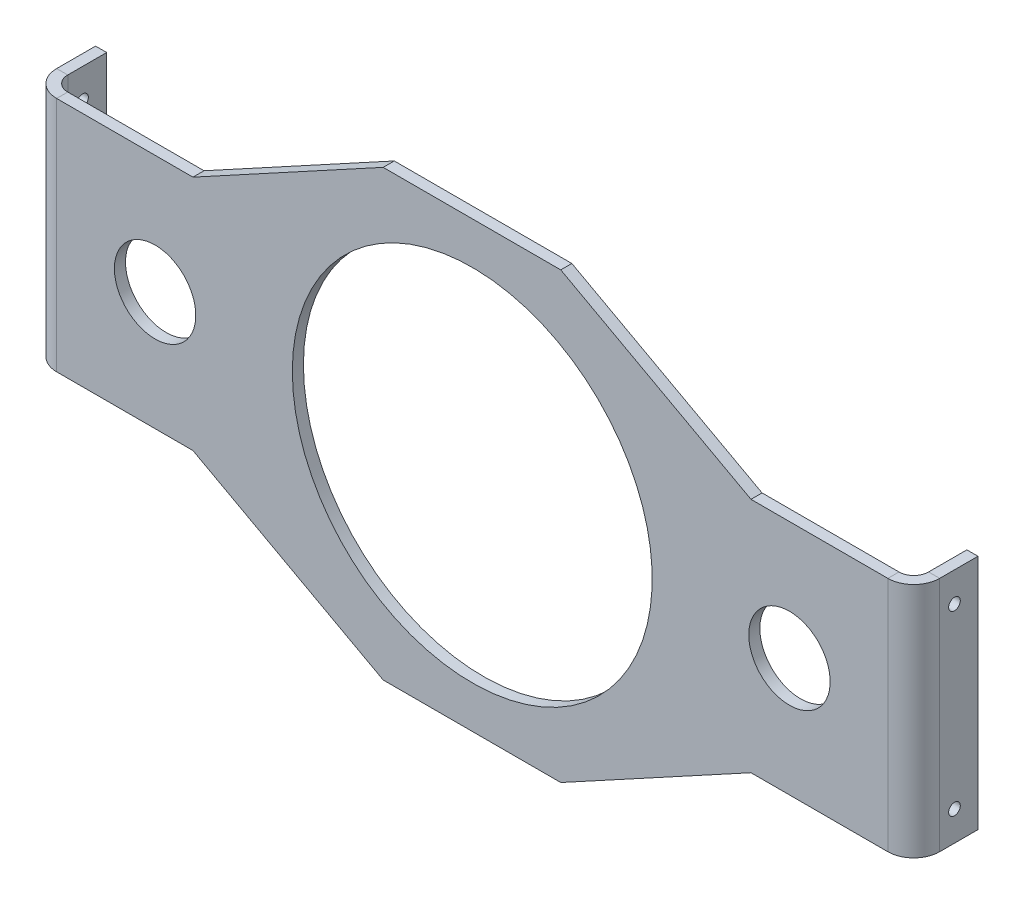
ISO-10303-21;
HEADER;
FILE_DESCRIPTION(('STEP AP214'),'2;1');
FILE_NAME('part.step','',(''),(''),'','','');
FILE_SCHEMA(('AUTOMOTIVE_DESIGN { 1 0 10303 214 1 1 1 1 }'));
ENDSEC;
DATA;
#1=APPLICATION_CONTEXT('core data for automotive mechanical design processes');
#2=APPLICATION_PROTOCOL_DEFINITION('international standard','automotive_design',2000,#1);
#3=PRODUCT_CONTEXT('',#1,'mechanical');
#4=PRODUCT('Part','Part','',(#3));
#5=PRODUCT_RELATED_PRODUCT_CATEGORY('part','',(#4));
#6=PRODUCT_DEFINITION_FORMATION('','',#4);
#7=PRODUCT_DEFINITION_CONTEXT('part definition',#1,'design');
#8=PRODUCT_DEFINITION('design','',#6,#7);
#9=PRODUCT_DEFINITION_SHAPE('','',#8);
#10=(LENGTH_UNIT() NAMED_UNIT(*) SI_UNIT(.MILLI.,.METRE.));
#11=(NAMED_UNIT(*) PLANE_ANGLE_UNIT() SI_UNIT($,.RADIAN.));
#12=(NAMED_UNIT(*) SI_UNIT($,.STERADIAN.) SOLID_ANGLE_UNIT());
#13=UNCERTAINTY_MEASURE_WITH_UNIT(LENGTH_MEASURE(1.E-05),#10,'distance_accuracy_value','');
#14=(GEOMETRIC_REPRESENTATION_CONTEXT(3) GLOBAL_UNCERTAINTY_ASSIGNED_CONTEXT((#13)) GLOBAL_UNIT_ASSIGNED_CONTEXT((#10,
#11,#12)) REPRESENTATION_CONTEXT('',''));
#15=CARTESIAN_POINT('',(0.,0.,0.));
#16=DIRECTION('',(0.,0.,1.));
#17=DIRECTION('',(1.,0.,0.));
#18=AXIS2_PLACEMENT_3D('',#15,#16,#17);
#19=CARTESIAN_POINT('',(0.,0.,2.38125));
#20=DIRECTION('',(0.,0.,-1.));
#21=DIRECTION('',(-1.,0.,0.));
#22=AXIS2_PLACEMENT_3D('',#19,#20,#21);
#23=PLANE('',#22);
#24=CARTESIAN_POINT('',(-18.9499999999988,57.1499999999993,2.38125));
#25=DIRECTION('',(0.,0.,-1.));
#26=DIRECTION('',(-1.,0.,0.));
#27=AXIS2_PLACEMENT_3D('',#24,#25,#26);
#28=CIRCLE('',#27,8.73125);
#29=CARTESIAN_POINT('',(-27.6812499999988,57.1499999999993,2.38125));
#30=VERTEX_POINT('',#29);
#31=EDGE_CURVE('E262',#30,#30,#28,.T.);
#32=ORIENTED_EDGE('',*,*,#31,.T.);
#33=EDGE_LOOP('',(#32));
#34=FACE_BOUND('',#33,.T.);
#35=CARTESIAN_POINT('',(117.150000000001,57.1499999999993,2.38125));
#36=DIRECTION('',(0.,0.,-1.));
#37=DIRECTION('',(-1.,0.,0.));
#38=AXIS2_PLACEMENT_3D('',#35,#36,#37);
#39=CIRCLE('',#38,8.73125);
#40=CARTESIAN_POINT('',(108.418750000001,57.1499999999993,2.38125));
#41=VERTEX_POINT('',#40);
#42=EDGE_CURVE('E259',#41,#41,#39,.T.);
#43=ORIENTED_EDGE('',*,*,#42,.T.);
#44=EDGE_LOOP('',(#43));
#45=FACE_BOUND('',#44,.T.);
#46=CARTESIAN_POINT('',(49.1000000000012,57.1499999999993,2.38125));
#47=DIRECTION('',(0.,0.,-1.));
#48=DIRECTION('',(-1.,0.,0.));
#49=AXIS2_PLACEMENT_3D('',#46,#47,#48);
#50=CIRCLE('',#49,38.608);
#51=CARTESIAN_POINT('',(10.4920000000012,57.1499999999993,2.38125));
#52=VERTEX_POINT('',#51);
#53=EDGE_CURVE('E256',#52,#52,#50,.T.);
#54=ORIENTED_EDGE('',*,*,#53,.T.);
#55=EDGE_LOOP('',(#54));
#56=FACE_BOUND('',#55,.T.);
#57=DIRECTION('',(-1.,0.,0.));
#58=VECTOR('',#57,1.);
#59=CARTESIAN_POINT('',(0.,82.55,2.38125));
#60=LINE('',#59,#58);
#61=CARTESIAN_POINT('',(-10.8241193173597,82.55,2.38125));
#62=VERTEX_POINT('',#61);
#63=CARTESIAN_POINT('',(-40.0658693173598,82.55,2.38125));
#64=VERTEX_POINT('',#63);
#65=EDGE_CURVE('E70',#62,#64,#60,.T.);
#66=ORIENTED_EDGE('',*,*,#65,.T.);
#67=DIRECTION('',(0.,-1.,0.));
#68=VECTOR('',#67,1.);
#69=CARTESIAN_POINT('',(-40.0658693173598,0.,2.38125));
#70=LINE('',#69,#68);
#71=CARTESIAN_POINT('',(-40.0658693173598,31.75,2.38125));
#72=VERTEX_POINT('',#71);
#73=EDGE_CURVE('E62',#64,#72,#70,.T.);
#74=ORIENTED_EDGE('',*,*,#73,.T.);
#75=DIRECTION('',(-1.,0.,0.));
#76=VECTOR('',#75,1.);
#77=CARTESIAN_POINT('',(0.,31.75,2.38125));
#78=LINE('',#77,#76);
#79=CARTESIAN_POINT('',(-10.8241193173597,31.75,2.38125));
#80=VERTEX_POINT('',#79);
#81=EDGE_CURVE('E78',#72,#80,#78,.F.);
#82=ORIENTED_EDGE('',*,*,#81,.T.);
#83=DIRECTION('',(0.878215054439322,-0.478265949191596,0.));
#84=VECTOR('',#83,1.);
#85=CARTESIAN_POINT('',(-10.8241193173597,31.75,2.38125));
#86=LINE('',#85,#84);
#87=CARTESIAN_POINT('',(29.9865,9.52499999999998,2.38125));
#88=VERTEX_POINT('',#87);
#89=EDGE_CURVE('E274',#80,#88,#86,.T.);
#90=ORIENTED_EDGE('',*,*,#89,.T.);
#91=DIRECTION('',(-1.,0.,0.));
#92=VECTOR('',#91,1.);
#93=CARTESIAN_POINT('',(0.,9.52499999999998,2.38125));
#94=LINE('',#93,#92);
#95=CARTESIAN_POINT('',(68.0865,9.52499999999998,2.38125));
#96=VERTEX_POINT('',#95);
#97=EDGE_CURVE('E271',#88,#96,#94,.F.);
#98=ORIENTED_EDGE('',*,*,#97,.T.);
#99=DIRECTION('',(0.878215054439322,0.478265949191596,0.));
#100=VECTOR('',#99,1.);
#101=CARTESIAN_POINT('',(68.0865,9.52499999999998,2.38125));
#102=LINE('',#101,#100);
#103=CARTESIAN_POINT('',(108.89711931736,31.75,2.38125));
#104=VERTEX_POINT('',#103);
#105=EDGE_CURVE('E268',#96,#104,#102,.T.);
#106=ORIENTED_EDGE('',*,*,#105,.T.);
#107=DIRECTION('',(-1.,0.,0.));
#108=VECTOR('',#107,1.);
#109=CARTESIAN_POINT('',(0.,31.75,2.38125));
#110=LINE('',#109,#108);
#111=CARTESIAN_POINT('',(138.26586931736,31.75,2.38125));
#112=VERTEX_POINT('',#111);
#113=EDGE_CURVE('E265',#104,#112,#110,.F.);
#114=ORIENTED_EDGE('',*,*,#113,.T.);
#115=DIRECTION('',(0.,-1.,0.));
#116=VECTOR('',#115,1.);
#117=CARTESIAN_POINT('',(138.26586931736,0.,2.38125));
#118=LINE('',#117,#116);
#119=CARTESIAN_POINT('',(138.26586931736,82.55,2.38125));
#120=VERTEX_POINT('',#119);
#121=EDGE_CURVE('E245',#120,#112,#118,.T.);
#122=ORIENTED_EDGE('',*,*,#121,.F.);
#123=DIRECTION('',(-1.,0.,0.));
#124=VECTOR('',#123,1.);
#125=CARTESIAN_POINT('',(0.,82.55,2.38125));
#126=LINE('',#125,#124);
#127=CARTESIAN_POINT('',(108.89711931736,82.55,2.38125));
#128=VERTEX_POINT('',#127);
#129=EDGE_CURVE('E285',#120,#128,#126,.T.);
#130=ORIENTED_EDGE('',*,*,#129,.T.);
#131=DIRECTION('',(-0.878215054439322,0.478265949191596,0.));
#132=VECTOR('',#131,1.);
#133=CARTESIAN_POINT('',(68.0865,104.775,2.38125));
#134=LINE('',#133,#132);
#135=CARTESIAN_POINT('',(68.0865,104.775,2.38125));
#136=VERTEX_POINT('',#135);
#137=EDGE_CURVE('E282',#128,#136,#134,.T.);
#138=ORIENTED_EDGE('',*,*,#137,.T.);
#139=DIRECTION('',(-1.,0.,0.));
#140=VECTOR('',#139,1.);
#141=CARTESIAN_POINT('',(0.,104.775,2.38125));
#142=LINE('',#141,#140);
#143=CARTESIAN_POINT('',(29.9865,104.775,2.38125));
#144=VERTEX_POINT('',#143);
#145=EDGE_CURVE('E279',#136,#144,#142,.T.);
#146=ORIENTED_EDGE('',*,*,#145,.T.);
#147=DIRECTION('',(-0.878215054439322,-0.478265949191596,0.));
#148=VECTOR('',#147,1.);
#149=CARTESIAN_POINT('',(-10.8241193173597,82.55,2.38125));
#150=LINE('',#149,#148);
#151=EDGE_CURVE('E277',#144,#62,#150,.T.);
#152=ORIENTED_EDGE('',*,*,#151,.T.);
#153=EDGE_LOOP('',(#66,#74,#82,#90,#98,#106,#114,#122,#130,#138,#146,#152));
#154=FACE_BOUND('',#153,.T.);
#155=ADVANCED_FACE('F53',(#34,#45,#56,#154),#23,.F.);
#156=CARTESIAN_POINT('',(143.82211931736,0.,141.948377031524));
#157=DIRECTION('',(-1.,0.,0.));
#158=DIRECTION('',(0.,0.,1.));
#159=AXIS2_PLACEMENT_3D('',#156,#157,#158);
#160=PLANE('',#159);
#161=CARTESIAN_POINT('',(143.82211931736,76.2,-6.35000000000025));
#162=DIRECTION('',(1.,0.,0.));
#163=DIRECTION('',(0.,0.,-1.));
#164=AXIS2_PLACEMENT_3D('',#161,#162,#163);
#165=CIRCLE('',#164,1.25);
#166=CARTESIAN_POINT('',(143.82211931736,76.2,-7.60000000000025));
#167=VERTEX_POINT('',#166);
#168=EDGE_CURVE('E918',#167,#167,#165,.T.);
#169=ORIENTED_EDGE('',*,*,#168,.F.);
#170=EDGE_LOOP('',(#169));
#171=FACE_BOUND('',#170,.T.);
#172=CARTESIAN_POINT('',(143.82211931736,38.1,-6.35000000000022));
#173=DIRECTION('',(1.,0.,0.));
#174=DIRECTION('',(0.,0.,-1.));
#175=AXIS2_PLACEMENT_3D('',#172,#173,#174);
#176=CIRCLE('',#175,1.25);
#177=CARTESIAN_POINT('',(143.82211931736,38.1,-7.60000000000022));
#178=VERTEX_POINT('',#177);
#179=EDGE_CURVE('E884',#178,#178,#176,.T.);
#180=ORIENTED_EDGE('',*,*,#179,.F.);
#181=EDGE_LOOP('',(#180));
#182=FACE_BOUND('',#181,.T.);
#183=DIRECTION('',(0.,0.,1.));
#184=VECTOR('',#183,1.);
#185=CARTESIAN_POINT('',(143.82211931736,82.55,141.948377031524));
#186=LINE('',#185,#184);
#187=CARTESIAN_POINT('',(143.82211931736,82.55,-11.398742285836));
#188=VERTEX_POINT('',#187);
#189=CARTESIAN_POINT('',(143.82211931736,82.55,-3.17500000000001));
#190=VERTEX_POINT('',#189);
#191=EDGE_CURVE('E252',#188,#190,#186,.T.);
#192=ORIENTED_EDGE('',*,*,#191,.T.);
#193=DIRECTION('',(0.,-1.,0.));
#194=VECTOR('',#193,1.);
#195=CARTESIAN_POINT('',(143.82211931736,0.,-3.17500000000001));
#196=LINE('',#195,#194);
#197=CARTESIAN_POINT('',(143.82211931736,31.75,-3.17500000000001));
#198=VERTEX_POINT('',#197);
#199=EDGE_CURVE('E363',#190,#198,#196,.T.);
#200=ORIENTED_EDGE('',*,*,#199,.T.);
#201=DIRECTION('',(0.,0.,1.));
#202=VECTOR('',#201,1.);
#203=CARTESIAN_POINT('',(143.82211931736,31.75,141.948377031524));
#204=LINE('',#203,#202);
#205=CARTESIAN_POINT('',(143.82211931736,31.75,-11.398742285836));
#206=VERTEX_POINT('',#205);
#207=EDGE_CURVE('E351',#198,#206,#204,.F.);
#208=ORIENTED_EDGE('',*,*,#207,.T.);
#209=DIRECTION('',(0.,1.,0.));
#210=VECTOR('',#209,1.);
#211=CARTESIAN_POINT('',(143.82211931736,0.,-11.398742285836));
#212=LINE('',#211,#210);
#213=EDGE_CURVE('E348',#206,#188,#212,.T.);
#214=ORIENTED_EDGE('',*,*,#213,.T.);
#215=EDGE_LOOP('',(#192,#200,#208,#214));
#216=FACE_BOUND('',#215,.T.);
#217=ADVANCED_FACE('F426',(#171,#182,#216),#160,.F.);
#218=CARTESIAN_POINT('',(141.44086931736,82.55,33.051257714164));
#219=DIRECTION('',(0.,-1.,0.));
#220=DIRECTION('',(0.,0.,1.));
#221=AXIS2_PLACEMENT_3D('',#218,#219,#220);
#222=PLANE('',#221);
#223=DIRECTION('',(-1.,0.,0.));
#224=VECTOR('',#223,1.);
#225=CARTESIAN_POINT('',(141.44086931736,82.55,-3.17500000000001));
#226=LINE('',#225,#224);
#227=CARTESIAN_POINT('',(141.44086931736,82.55,-3.17500000000001));
#228=VERTEX_POINT('',#227);
#229=EDGE_CURVE('E366',#190,#228,#226,.T.);
#230=ORIENTED_EDGE('',*,*,#229,.F.);
#231=ORIENTED_EDGE('',*,*,#191,.F.);
#232=DIRECTION('',(-1.,0.,0.));
#233=VECTOR('',#232,1.);
#234=CARTESIAN_POINT('',(141.44086931736,82.55,-11.398742285836));
#235=LINE('',#234,#233);
#236=CARTESIAN_POINT('',(141.44086931736,82.55,-11.398742285836));
#237=VERTEX_POINT('',#236);
#238=EDGE_CURVE('E355',#188,#237,#235,.T.);
#239=ORIENTED_EDGE('',*,*,#238,.T.);
#240=DIRECTION('',(0.,0.,1.));
#241=VECTOR('',#240,1.);
#242=CARTESIAN_POINT('',(141.44086931736,82.55,33.051257714164));
#243=LINE('',#242,#241);
#244=EDGE_CURVE('E347',#237,#228,#243,.T.);
#245=ORIENTED_EDGE('',*,*,#244,.T.);
#246=EDGE_LOOP('',(#230,#231,#239,#245));
#247=FACE_BOUND('',#246,.T.);
#248=ADVANCED_FACE('F441',(#247),#222,.F.);
#249=CARTESIAN_POINT('',(141.44086931736,31.75,-11.398742285836));
#250=DIRECTION('',(0.,0.,1.));
#251=DIRECTION('',(0.,1.,0.));
#252=AXIS2_PLACEMENT_3D('',#249,#250,#251);
#253=PLANE('',#252);
#254=ORIENTED_EDGE('',*,*,#238,.F.);
#255=ORIENTED_EDGE('',*,*,#213,.F.);
#256=DIRECTION('',(-1.,0.,0.));
#257=VECTOR('',#256,1.);
#258=CARTESIAN_POINT('',(141.44086931736,31.75,-11.398742285836));
#259=LINE('',#258,#257);
#260=CARTESIAN_POINT('',(141.44086931736,31.75,-11.398742285836));
#261=VERTEX_POINT('',#260);
#262=EDGE_CURVE('E352',#206,#261,#259,.T.);
#263=ORIENTED_EDGE('',*,*,#262,.T.);
#264=DIRECTION('',(0.,1.,0.));
#265=VECTOR('',#264,1.);
#266=CARTESIAN_POINT('',(141.44086931736,31.75,-11.398742285836));
#267=LINE('',#266,#265);
#268=EDGE_CURVE('E343',#261,#237,#267,.T.);
#269=ORIENTED_EDGE('',*,*,#268,.T.);
#270=EDGE_LOOP('',(#254,#255,#263,#269));
#271=FACE_BOUND('',#270,.T.);
#272=ADVANCED_FACE('F438',(#271),#253,.F.);
#273=CARTESIAN_POINT('',(141.44086931736,31.75,33.051257714164));
#274=DIRECTION('',(0.,1.,0.));
#275=DIRECTION('',(0.,0.,-1.));
#276=AXIS2_PLACEMENT_3D('',#273,#274,#275);
#277=PLANE('',#276);
#278=DIRECTION('',(1.,0.,0.));
#279=VECTOR('',#278,1.);
#280=CARTESIAN_POINT('',(141.44086931736,31.75,-3.17500000000001));
#281=LINE('',#280,#279);
#282=CARTESIAN_POINT('',(141.44086931736,31.75,-3.17500000000001));
#283=VERTEX_POINT('',#282);
#284=EDGE_CURVE('E360',#283,#198,#281,.T.);
#285=ORIENTED_EDGE('',*,*,#284,.F.);
#286=DIRECTION('',(0.,0.,-1.));
#287=VECTOR('',#286,1.);
#288=CARTESIAN_POINT('',(141.44086931736,31.75,33.051257714164));
#289=LINE('',#288,#287);
#290=EDGE_CURVE('E346',#283,#261,#289,.T.);
#291=ORIENTED_EDGE('',*,*,#290,.T.);
#292=ORIENTED_EDGE('',*,*,#262,.F.);
#293=ORIENTED_EDGE('',*,*,#207,.F.);
#294=EDGE_LOOP('',(#285,#291,#292,#293));
#295=FACE_BOUND('',#294,.T.);
#296=ADVANCED_FACE('F432',(#295),#277,.F.);
#297=CARTESIAN_POINT('',(141.44086931736,0.,141.948377031524));
#298=DIRECTION('',(-1.,0.,0.));
#299=DIRECTION('',(0.,0.,1.));
#300=AXIS2_PLACEMENT_3D('',#297,#298,#299);
#301=PLANE('',#300);
#302=CARTESIAN_POINT('',(141.44086931736,76.2,-6.35000000000024));
#303=DIRECTION('',(-1.,0.,0.));
#304=DIRECTION('',(0.,0.,1.));
#305=AXIS2_PLACEMENT_3D('',#302,#303,#304);
#306=CIRCLE('',#305,1.25);
#307=CARTESIAN_POINT('',(141.44086931736,76.2,-5.10000000000024));
#308=VERTEX_POINT('',#307);
#309=EDGE_CURVE('E889',#308,#308,#306,.T.);
#310=ORIENTED_EDGE('',*,*,#309,.F.);
#311=EDGE_LOOP('',(#310));
#312=FACE_BOUND('',#311,.T.);
#313=CARTESIAN_POINT('',(141.44086931736,38.1,-6.35000000000021));
#314=DIRECTION('',(-1.,0.,0.));
#315=DIRECTION('',(0.,0.,1.));
#316=AXIS2_PLACEMENT_3D('',#313,#314,#315);
#317=CIRCLE('',#316,1.25);
#318=CARTESIAN_POINT('',(141.44086931736,38.1,-5.10000000000021));
#319=VERTEX_POINT('',#318);
#320=EDGE_CURVE('E225',#319,#319,#317,.T.);
#321=ORIENTED_EDGE('',*,*,#320,.F.);
#322=EDGE_LOOP('',(#321));
#323=FACE_BOUND('',#322,.T.);
#324=DIRECTION('',(0.,-1.,0.));
#325=VECTOR('',#324,1.);
#326=CARTESIAN_POINT('',(141.44086931736,0.,-3.17500000000001));
#327=LINE('',#326,#325);
#328=EDGE_CURVE('E357',#228,#283,#327,.T.);
#329=ORIENTED_EDGE('',*,*,#328,.F.);
#330=ORIENTED_EDGE('',*,*,#244,.F.);
#331=ORIENTED_EDGE('',*,*,#268,.F.);
#332=ORIENTED_EDGE('',*,*,#290,.F.);
#333=EDGE_LOOP('',(#329,#330,#331,#332));
#334=FACE_BOUND('',#333,.T.);
#335=ADVANCED_FACE('F435',(#312,#323,#334),#301,.T.);
#336=CARTESIAN_POINT('',(68.0865,104.775,0.));
#337=DIRECTION('',(-0.478265949191596,-0.878215054439322,0.));
#338=DIRECTION('',(-0.878215054439322,0.478265949191596,0.));
#339=AXIS2_PLACEMENT_3D('',#336,#337,#338);
#340=PLANE('',#339);
#341=DIRECTION('',(0.,0.,-1.));
#342=VECTOR('',#341,1.);
#343=CARTESIAN_POINT('',(68.0865,104.775,0.));
#344=LINE('',#343,#342);
#345=CARTESIAN_POINT('',(68.0865,104.775,0.));
#346=VERTEX_POINT('',#345);
#347=EDGE_CURVE('E334',#136,#346,#344,.T.);
#348=ORIENTED_EDGE('',*,*,#347,.F.);
#349=ORIENTED_EDGE('',*,*,#137,.F.);
#350=DIRECTION('',(0.,0.,-1.));
#351=VECTOR('',#350,1.);
#352=CARTESIAN_POINT('',(108.89711931736,82.55,0.));
#353=LINE('',#352,#351);
#354=CARTESIAN_POINT('',(108.89711931736,82.55,0.));
#355=VERTEX_POINT('',#354);
#356=EDGE_CURVE('E339',#128,#355,#353,.T.);
#357=ORIENTED_EDGE('',*,*,#356,.T.);
#358=DIRECTION('',(-0.878215054439322,0.478265949191596,0.));
#359=VECTOR('',#358,1.);
#360=CARTESIAN_POINT('',(68.0865,104.775,0.));
#361=LINE('',#360,#359);
#362=EDGE_CURVE('E336',#355,#346,#361,.T.);
#363=ORIENTED_EDGE('',*,*,#362,.T.);
#364=EDGE_LOOP('',(#348,#349,#357,#363));
#365=FACE_BOUND('',#364,.T.);
#366=ADVANCED_FACE('F482',(#365),#340,.F.);
#367=CARTESIAN_POINT('',(29.9865,104.775,0.));
#368=DIRECTION('',(0.,-1.,0.));
#369=DIRECTION('',(-1.,0.,0.));
#370=AXIS2_PLACEMENT_3D('',#367,#368,#369);
#371=PLANE('',#370);
#372=DIRECTION('',(0.,0.,-1.));
#373=VECTOR('',#372,1.);
#374=CARTESIAN_POINT('',(29.9865,104.775,0.));
#375=LINE('',#374,#373);
#376=CARTESIAN_POINT('',(29.9865,104.775,0.));
#377=VERTEX_POINT('',#376);
#378=EDGE_CURVE('E329',#144,#377,#375,.T.);
#379=ORIENTED_EDGE('',*,*,#378,.F.);
#380=ORIENTED_EDGE('',*,*,#145,.F.);
#381=ORIENTED_EDGE('',*,*,#347,.T.);
#382=DIRECTION('',(-1.,0.,0.));
#383=VECTOR('',#382,1.);
#384=CARTESIAN_POINT('',(29.9865,104.775,0.));
#385=LINE('',#384,#383);
#386=EDGE_CURVE('E331',#346,#377,#385,.T.);
#387=ORIENTED_EDGE('',*,*,#386,.T.);
#388=EDGE_LOOP('',(#379,#380,#381,#387));
#389=FACE_BOUND('',#388,.T.);
#390=ADVANCED_FACE('F501',(#389),#371,.F.);
#391=CARTESIAN_POINT('',(-10.8241193173597,82.55,0.));
#392=DIRECTION('',(0.478265949191596,-0.878215054439322,0.));
#393=DIRECTION('',(-0.878215054439322,-0.478265949191596,0.));
#394=AXIS2_PLACEMENT_3D('',#391,#392,#393);
#395=PLANE('',#394);
#396=DIRECTION('',(0.,0.,-1.));
#397=VECTOR('',#396,1.);
#398=CARTESIAN_POINT('',(-10.8241193173597,82.55,0.));
#399=LINE('',#398,#397);
#400=CARTESIAN_POINT('',(-10.8241193173597,82.55,0.));
#401=VERTEX_POINT('',#400);
#402=EDGE_CURVE('E323',#62,#401,#399,.T.);
#403=ORIENTED_EDGE('',*,*,#402,.F.);
#404=ORIENTED_EDGE('',*,*,#151,.F.);
#405=ORIENTED_EDGE('',*,*,#378,.T.);
#406=DIRECTION('',(-0.878215054439322,-0.478265949191596,0.));
#407=VECTOR('',#406,1.);
#408=CARTESIAN_POINT('',(-10.8241193173597,82.55,0.));
#409=LINE('',#408,#407);
#410=EDGE_CURVE('E326',#377,#401,#409,.T.);
#411=ORIENTED_EDGE('',*,*,#410,.T.);
#412=EDGE_LOOP('',(#403,#404,#405,#411));
#413=FACE_BOUND('',#412,.T.);
#414=ADVANCED_FACE('F509',(#413),#395,.F.);
#415=CARTESIAN_POINT('',(-55.2741193173597,82.55,0.));
#416=DIRECTION('',(0.,-1.,0.));
#417=DIRECTION('',(-1.,0.,0.));
#418=AXIS2_PLACEMENT_3D('',#415,#416,#417);
#419=PLANE('',#418);
#420=DIRECTION('',(0.,0.,-1.));
#421=VECTOR('',#420,1.);
#422=CARTESIAN_POINT('',(-40.0658693173598,82.55,0.));
#423=LINE('',#422,#421);
#424=CARTESIAN_POINT('',(-40.0658693173598,82.55,0.));
#425=VERTEX_POINT('',#424);
#426=EDGE_CURVE('E14',#64,#425,#423,.T.);
#427=ORIENTED_EDGE('',*,*,#426,.F.);
#428=ORIENTED_EDGE('',*,*,#65,.F.);
#429=ORIENTED_EDGE('',*,*,#402,.T.);
#430=DIRECTION('',(-1.,0.,0.));
#431=VECTOR('',#430,1.);
#432=CARTESIAN_POINT('',(-55.2741193173597,82.55,0.));
#433=LINE('',#432,#431);
#434=EDGE_CURVE('E325',#401,#425,#433,.T.);
#435=ORIENTED_EDGE('',*,*,#434,.T.);
#436=EDGE_LOOP('',(#427,#428,#429,#435));
#437=FACE_BOUND('',#436,.T.);
#438=ADVANCED_FACE('F55',(#437),#419,.F.);
#439=CARTESIAN_POINT('',(-55.2741193173597,31.75,0.));
#440=DIRECTION('',(0.,1.,0.));
#441=DIRECTION('',(1.,0.,0.));
#442=AXIS2_PLACEMENT_3D('',#439,#440,#441);
#443=PLANE('',#442);
#444=DIRECTION('',(0.,0.,1.));
#445=VECTOR('',#444,1.);
#446=CARTESIAN_POINT('',(-40.0658693173598,31.75,0.));
#447=LINE('',#446,#445);
#448=CARTESIAN_POINT('',(-40.0658693173598,31.75,0.));
#449=VERTEX_POINT('',#448);
#450=EDGE_CURVE('E377',#449,#72,#447,.T.);
#451=ORIENTED_EDGE('',*,*,#450,.F.);
#452=DIRECTION('',(1.,0.,0.));
#453=VECTOR('',#452,1.);
#454=CARTESIAN_POINT('',(-55.2741193173597,31.75,0.));
#455=LINE('',#454,#453);
#456=CARTESIAN_POINT('',(-10.8241193173597,31.75,0.));
#457=VERTEX_POINT('',#456);
#458=EDGE_CURVE('E57',#449,#457,#455,.T.);
#459=ORIENTED_EDGE('',*,*,#458,.T.);
#460=DIRECTION('',(0.,0.,-1.));
#461=VECTOR('',#460,1.);
#462=CARTESIAN_POINT('',(-10.8241193173597,31.75,0.));
#463=LINE('',#462,#461);
#464=EDGE_CURVE('E320',#80,#457,#463,.T.);
#465=ORIENTED_EDGE('',*,*,#464,.F.);
#466=ORIENTED_EDGE('',*,*,#81,.F.);
#467=EDGE_LOOP('',(#451,#459,#465,#466));
#468=FACE_BOUND('',#467,.T.);
#469=ADVANCED_FACE('F385',(#468),#443,.F.);
#470=CARTESIAN_POINT('',(-10.8241193173597,31.75,0.));
#471=DIRECTION('',(0.478265949191596,0.878215054439322,0.));
#472=DIRECTION('',(0.878215054439322,-0.478265949191596,0.));
#473=AXIS2_PLACEMENT_3D('',#470,#471,#472);
#474=PLANE('',#473);
#475=DIRECTION('',(0.,0.,-1.));
#476=VECTOR('',#475,1.);
#477=CARTESIAN_POINT('',(29.9865,9.52499999999998,0.));
#478=LINE('',#477,#476);
#479=CARTESIAN_POINT('',(29.9865,9.52499999999998,0.));
#480=VERTEX_POINT('',#479);
#481=EDGE_CURVE('E315',#88,#480,#478,.T.);
#482=ORIENTED_EDGE('',*,*,#481,.F.);
#483=ORIENTED_EDGE('',*,*,#89,.F.);
#484=ORIENTED_EDGE('',*,*,#464,.T.);
#485=DIRECTION('',(0.878215054439322,-0.478265949191596,0.));
#486=VECTOR('',#485,1.);
#487=CARTESIAN_POINT('',(-10.8241193173597,31.75,0.));
#488=LINE('',#487,#486);
#489=EDGE_CURVE('E317',#457,#480,#488,.T.);
#490=ORIENTED_EDGE('',*,*,#489,.T.);
#491=EDGE_LOOP('',(#482,#483,#484,#490));
#492=FACE_BOUND('',#491,.T.);
#493=ADVANCED_FACE('F388',(#492),#474,.F.);
#494=CARTESIAN_POINT('',(29.9865,9.52499999999998,0.));
#495=DIRECTION('',(0.,1.,0.));
#496=DIRECTION('',(1.,0.,0.));
#497=AXIS2_PLACEMENT_3D('',#494,#495,#496);
#498=PLANE('',#497);
#499=DIRECTION('',(0.,0.,-1.));
#500=VECTOR('',#499,1.);
#501=CARTESIAN_POINT('',(68.0865,9.52499999999998,0.));
#502=LINE('',#501,#500);
#503=CARTESIAN_POINT('',(68.0865,9.52499999999998,0.));
#504=VERTEX_POINT('',#503);
#505=EDGE_CURVE('E310',#96,#504,#502,.T.);
#506=ORIENTED_EDGE('',*,*,#505,.F.);
#507=ORIENTED_EDGE('',*,*,#97,.F.);
#508=ORIENTED_EDGE('',*,*,#481,.T.);
#509=DIRECTION('',(1.,0.,0.));
#510=VECTOR('',#509,1.);
#511=CARTESIAN_POINT('',(29.9865,9.52499999999998,0.));
#512=LINE('',#511,#510);
#513=EDGE_CURVE('E312',#480,#504,#512,.T.);
#514=ORIENTED_EDGE('',*,*,#513,.T.);
#515=EDGE_LOOP('',(#506,#507,#508,#514));
#516=FACE_BOUND('',#515,.T.);
#517=ADVANCED_FACE('F391',(#516),#498,.F.);
#518=CARTESIAN_POINT('',(68.0865,9.52499999999998,0.));
#519=DIRECTION('',(-0.478265949191596,0.878215054439322,0.));
#520=DIRECTION('',(0.878215054439322,0.478265949191596,0.));
#521=AXIS2_PLACEMENT_3D('',#518,#519,#520);
#522=PLANE('',#521);
#523=DIRECTION('',(0.,0.,-1.));
#524=VECTOR('',#523,1.);
#525=CARTESIAN_POINT('',(108.89711931736,31.75,0.));
#526=LINE('',#525,#524);
#527=CARTESIAN_POINT('',(108.89711931736,31.75,0.));
#528=VERTEX_POINT('',#527);
#529=EDGE_CURVE('E287',#104,#528,#526,.T.);
#530=ORIENTED_EDGE('',*,*,#529,.F.);
#531=ORIENTED_EDGE('',*,*,#105,.F.);
#532=ORIENTED_EDGE('',*,*,#505,.T.);
#533=DIRECTION('',(0.878215054439322,0.478265949191596,0.));
#534=VECTOR('',#533,1.);
#535=CARTESIAN_POINT('',(68.0865,9.52499999999998,0.));
#536=LINE('',#535,#534);
#537=EDGE_CURVE('E307',#504,#528,#536,.T.);
#538=ORIENTED_EDGE('',*,*,#537,.T.);
#539=EDGE_LOOP('',(#530,#531,#532,#538));
#540=FACE_BOUND('',#539,.T.);
#541=ADVANCED_FACE('F399',(#540),#522,.F.);
#542=CARTESIAN_POINT('',(49.1000000000012,57.1499999999993,0.));
#543=DIRECTION('',(0.,0.,-1.));
#544=DIRECTION('',(-1.,0.,0.));
#545=AXIS2_PLACEMENT_3D('',#542,#543,#544);
#546=CYLINDRICAL_SURFACE('',#545,38.608);
#547=CARTESIAN_POINT('',(49.1000000000012,57.1499999999993,0.));
#548=DIRECTION('',(0.,0.,-1.));
#549=DIRECTION('',(-1.,0.,0.));
#550=AXIS2_PLACEMENT_3D('',#547,#548,#549);
#551=CIRCLE('',#550,38.608);
#552=CARTESIAN_POINT('',(10.4920000000012,57.1499999999993,0.));
#553=VERTEX_POINT('',#552);
#554=EDGE_CURVE('E304',#553,#553,#551,.T.);
#555=ORIENTED_EDGE('',*,*,#554,.T.);
#556=EDGE_LOOP('',(#555));
#557=FACE_BOUND('',#556,.T.);
#558=ORIENTED_EDGE('',*,*,#53,.F.);
#559=EDGE_LOOP('',(#558));
#560=FACE_BOUND('',#559,.T.);
#561=ADVANCED_FACE('F472',(#557,#560),#546,.F.);
#562=CARTESIAN_POINT('',(117.150000000001,57.1499999999993,0.));
#563=DIRECTION('',(0.,0.,-1.));
#564=DIRECTION('',(-1.,0.,0.));
#565=AXIS2_PLACEMENT_3D('',#562,#563,#564);
#566=CYLINDRICAL_SURFACE('',#565,8.73125);
#567=CARTESIAN_POINT('',(117.150000000001,57.1499999999993,0.));
#568=DIRECTION('',(0.,0.,-1.));
#569=DIRECTION('',(-1.,0.,0.));
#570=AXIS2_PLACEMENT_3D('',#567,#568,#569);
#571=CIRCLE('',#570,8.73125);
#572=CARTESIAN_POINT('',(108.418750000001,57.1499999999993,0.));
#573=VERTEX_POINT('',#572);
#574=EDGE_CURVE('E301',#573,#573,#571,.T.);
#575=ORIENTED_EDGE('',*,*,#574,.T.);
#576=EDGE_LOOP('',(#575));
#577=FACE_BOUND('',#576,.T.);
#578=ORIENTED_EDGE('',*,*,#42,.F.);
#579=EDGE_LOOP('',(#578));
#580=FACE_BOUND('',#579,.T.);
#581=ADVANCED_FACE('F466',(#577,#580),#566,.F.);
#582=CARTESIAN_POINT('',(-18.9499999999988,57.1499999999993,0.));
#583=DIRECTION('',(0.,0.,-1.));
#584=DIRECTION('',(-1.,0.,0.));
#585=AXIS2_PLACEMENT_3D('',#582,#583,#584);
#586=CYLINDRICAL_SURFACE('',#585,8.73125);
#587=CARTESIAN_POINT('',(-18.9499999999988,57.1499999999993,0.));
#588=DIRECTION('',(0.,0.,-1.));
#589=DIRECTION('',(-1.,0.,0.));
#590=AXIS2_PLACEMENT_3D('',#587,#588,#589);
#591=CIRCLE('',#590,8.73125);
#592=CARTESIAN_POINT('',(-27.6812499999988,57.1499999999993,0.));
#593=VERTEX_POINT('',#592);
#594=EDGE_CURVE('E298',#593,#593,#591,.T.);
#595=ORIENTED_EDGE('',*,*,#594,.T.);
#596=EDGE_LOOP('',(#595));
#597=FACE_BOUND('',#596,.T.);
#598=ORIENTED_EDGE('',*,*,#31,.F.);
#599=EDGE_LOOP('',(#598));
#600=FACE_BOUND('',#599,.T.);
#601=ADVANCED_FACE('F460',(#597,#600),#586,.F.);
#602=CARTESIAN_POINT('',(0.,0.,0.));
#603=DIRECTION('',(0.,0.,-1.));
#604=DIRECTION('',(-1.,0.,0.));
#605=AXIS2_PLACEMENT_3D('',#602,#603,#604);
#606=PLANE('',#605);
#607=DIRECTION('',(0.,-1.,0.));
#608=VECTOR('',#607,1.);
#609=CARTESIAN_POINT('',(-40.0658693173598,0.,0.));
#610=LINE('',#609,#608);
#611=EDGE_CURVE('E369',#425,#449,#610,.T.);
#612=ORIENTED_EDGE('',*,*,#611,.F.);
#613=ORIENTED_EDGE('',*,*,#434,.F.);
#614=ORIENTED_EDGE('',*,*,#410,.F.);
#615=ORIENTED_EDGE('',*,*,#386,.F.);
#616=ORIENTED_EDGE('',*,*,#362,.F.);
#617=DIRECTION('',(-1.,0.,0.));
#618=VECTOR('',#617,1.);
#619=CARTESIAN_POINT('',(108.89711931736,82.55,0.));
#620=LINE('',#619,#618);
#621=CARTESIAN_POINT('',(138.26586931736,82.55,0.));
#622=VERTEX_POINT('',#621);
#623=EDGE_CURVE('E250',#622,#355,#620,.T.);
#624=ORIENTED_EDGE('',*,*,#623,.F.);
#625=DIRECTION('',(0.,-1.,0.));
#626=VECTOR('',#625,1.);
#627=CARTESIAN_POINT('',(138.26586931736,0.,0.));
#628=LINE('',#627,#626);
#629=CARTESIAN_POINT('',(138.26586931736,31.75,0.));
#630=VERTEX_POINT('',#629);
#631=EDGE_CURVE('E295',#622,#630,#628,.T.);
#632=ORIENTED_EDGE('',*,*,#631,.T.);
#633=DIRECTION('',(1.,0.,0.));
#634=VECTOR('',#633,1.);
#635=CARTESIAN_POINT('',(108.89711931736,31.75,0.));
#636=LINE('',#635,#634);
#637=EDGE_CURVE('E292',#528,#630,#636,.T.);
#638=ORIENTED_EDGE('',*,*,#637,.F.);
#639=ORIENTED_EDGE('',*,*,#537,.F.);
#640=ORIENTED_EDGE('',*,*,#513,.F.);
#641=ORIENTED_EDGE('',*,*,#489,.F.);
#642=ORIENTED_EDGE('',*,*,#458,.F.);
#643=EDGE_LOOP('',(#612,#613,#614,#615,#616,#624,#632,#638,#639,#640,#641,#642));
#644=FACE_BOUND('',#643,.T.);
#645=ORIENTED_EDGE('',*,*,#594,.F.);
#646=EDGE_LOOP('',(#645));
#647=FACE_BOUND('',#646,.T.);
#648=ORIENTED_EDGE('',*,*,#574,.F.);
#649=EDGE_LOOP('',(#648));
#650=FACE_BOUND('',#649,.T.);
#651=ORIENTED_EDGE('',*,*,#554,.F.);
#652=EDGE_LOOP('',(#651));
#653=FACE_BOUND('',#652,.T.);
#654=ADVANCED_FACE('F395',(#644,#647,#650,#653),#606,.T.);
#655=CARTESIAN_POINT('',(108.89711931736,31.75,0.));
#656=DIRECTION('',(0.,1.,0.));
#657=DIRECTION('',(1.,0.,0.));
#658=AXIS2_PLACEMENT_3D('',#655,#656,#657);
#659=PLANE('',#658);
#660=ORIENTED_EDGE('',*,*,#637,.T.);
#661=DIRECTION('',(0.,0.,1.));
#662=VECTOR('',#661,1.);
#663=CARTESIAN_POINT('',(138.26586931736,31.75,0.));
#664=LINE('',#663,#662);
#665=EDGE_CURVE('E289',#630,#112,#664,.T.);
#666=ORIENTED_EDGE('',*,*,#665,.T.);
#667=ORIENTED_EDGE('',*,*,#113,.F.);
#668=ORIENTED_EDGE('',*,*,#529,.T.);
#669=EDGE_LOOP('',(#660,#666,#667,#668));
#670=FACE_BOUND('',#669,.T.);
#671=ADVANCED_FACE('F404',(#670),#659,.F.);
#672=CARTESIAN_POINT('',(108.89711931736,82.55,0.));
#673=DIRECTION('',(0.,-1.,0.));
#674=DIRECTION('',(-1.,0.,0.));
#675=AXIS2_PLACEMENT_3D('',#672,#673,#674);
#676=PLANE('',#675);
#677=ORIENTED_EDGE('',*,*,#129,.F.);
#678=DIRECTION('',(0.,0.,-1.));
#679=VECTOR('',#678,1.);
#680=CARTESIAN_POINT('',(138.26586931736,82.55,0.));
#681=LINE('',#680,#679);
#682=EDGE_CURVE('E253',#120,#622,#681,.T.);
#683=ORIENTED_EDGE('',*,*,#682,.T.);
#684=ORIENTED_EDGE('',*,*,#623,.T.);
#685=ORIENTED_EDGE('',*,*,#356,.F.);
#686=EDGE_LOOP('',(#677,#683,#684,#685));
#687=FACE_BOUND('',#686,.T.);
#688=ADVANCED_FACE('F418',(#687),#676,.F.);
#689=CARTESIAN_POINT('',(138.26586931736,82.55,-3.175));
#690=DIRECTION('',(0.,-1.,0.));
#691=DIRECTION('',(0.,0.,-1.));
#692=AXIS2_PLACEMENT_3D('',#689,#690,#691);
#693=PLANE('',#692);
#694=ORIENTED_EDGE('',*,*,#682,.F.);
#695=CARTESIAN_POINT('',(138.26586931736,82.55,-3.175));
#696=DIRECTION('',(0.,-1.,0.));
#697=DIRECTION('',(0.,0.,-1.));
#698=AXIS2_PLACEMENT_3D('',#695,#696,#697);
#699=CIRCLE('',#698,5.55625);
#700=EDGE_CURVE('E233',#120,#190,#699,.F.);
#701=ORIENTED_EDGE('',*,*,#700,.T.);
#702=ORIENTED_EDGE('',*,*,#229,.T.);
#703=CARTESIAN_POINT('',(138.26586931736,82.55,-3.175));
#704=DIRECTION('',(0.,1.,0.));
#705=DIRECTION('',(0.,0.,-1.));
#706=AXIS2_PLACEMENT_3D('',#703,#704,#705);
#707=CIRCLE('',#706,3.17500000000001);
#708=EDGE_CURVE('E238',#622,#228,#707,.T.);
#709=ORIENTED_EDGE('',*,*,#708,.F.);
#710=EDGE_LOOP('',(#694,#701,#702,#709));
#711=FACE_BOUND('',#710,.T.);
#712=ADVANCED_FACE('F421',(#711),#693,.F.);
#713=CARTESIAN_POINT('',(138.26586931736,31.75,-3.175));
#714=DIRECTION('',(0.,1.,0.));
#715=DIRECTION('',(0.,0.,1.));
#716=AXIS2_PLACEMENT_3D('',#713,#714,#715);
#717=PLANE('',#716);
#718=ORIENTED_EDGE('',*,*,#284,.T.);
#719=CARTESIAN_POINT('',(138.26586931736,31.75,-3.175));
#720=DIRECTION('',(0.,-1.,0.));
#721=DIRECTION('',(0.,0.,-1.));
#722=AXIS2_PLACEMENT_3D('',#719,#720,#721);
#723=CIRCLE('',#722,5.55625);
#724=EDGE_CURVE('E242',#198,#112,#723,.T.);
#725=ORIENTED_EDGE('',*,*,#724,.T.);
#726=ORIENTED_EDGE('',*,*,#665,.F.);
#727=CARTESIAN_POINT('',(138.26586931736,31.75,-3.175));
#728=DIRECTION('',(0.,-1.,0.));
#729=DIRECTION('',(0.,0.,1.));
#730=AXIS2_PLACEMENT_3D('',#727,#728,#729);
#731=CIRCLE('',#730,3.17500000000001);
#732=EDGE_CURVE('E241',#283,#630,#731,.T.);
#733=ORIENTED_EDGE('',*,*,#732,.F.);
#734=EDGE_LOOP('',(#718,#725,#726,#733));
#735=FACE_BOUND('',#734,.T.);
#736=ADVANCED_FACE('F407',(#735),#717,.F.);
#737=CARTESIAN_POINT('',(138.26586931736,108.466038074001,-3.175));
#738=DIRECTION('',(0.,-1.,0.));
#739=DIRECTION('',(0.,0.,-1.));
#740=AXIS2_PLACEMENT_3D('',#737,#738,#739);
#741=CYLINDRICAL_SURFACE('',#740,3.175);
#742=ORIENTED_EDGE('',*,*,#732,.T.);
#743=ORIENTED_EDGE('',*,*,#631,.F.);
#744=ORIENTED_EDGE('',*,*,#708,.T.);
#745=ORIENTED_EDGE('',*,*,#328,.T.);
#746=EDGE_LOOP('',(#742,#743,#744,#745));
#747=FACE_BOUND('',#746,.T.);
#748=ADVANCED_FACE('F411',(#747),#741,.F.);
#749=CARTESIAN_POINT('',(138.26586931736,108.466038074001,-3.175));
#750=DIRECTION('',(0.,-1.,0.));
#751=DIRECTION('',(0.,0.,-1.));
#752=AXIS2_PLACEMENT_3D('',#749,#750,#751);
#753=CYLINDRICAL_SURFACE('',#752,5.55625);
#754=ORIENTED_EDGE('',*,*,#724,.F.);
#755=ORIENTED_EDGE('',*,*,#199,.F.);
#756=ORIENTED_EDGE('',*,*,#700,.F.);
#757=ORIENTED_EDGE('',*,*,#121,.T.);
#758=EDGE_LOOP('',(#754,#755,#756,#757));
#759=FACE_BOUND('',#758,.T.);
#760=ADVANCED_FACE('F424',(#759),#753,.T.);
#761=CARTESIAN_POINT('',(-40.0658693173598,82.55,-3.175));
#762=DIRECTION('',(0.,-1.,0.));
#763=DIRECTION('',(0.,0.,-1.));
#764=AXIS2_PLACEMENT_3D('',#761,#762,#763);
#765=PLANE('',#764);
#766=DIRECTION('',(1.,0.,0.));
#767=VECTOR('',#766,1.);
#768=CARTESIAN_POINT('',(-43.2408693173598,82.55,-3.17500000000001));
#769=LINE('',#768,#767);
#770=CARTESIAN_POINT('',(-45.6221193173598,82.55,-3.17500000000002));
#771=VERTEX_POINT('',#770);
#772=CARTESIAN_POINT('',(-43.2408693173598,82.55,-3.17500000000001));
#773=VERTEX_POINT('',#772);
#774=EDGE_CURVE('E200',#771,#773,#769,.T.);
#775=ORIENTED_EDGE('',*,*,#774,.F.);
#776=CARTESIAN_POINT('',(-40.0658693173598,82.55,-3.175));
#777=DIRECTION('',(0.,1.,0.));
#778=DIRECTION('',(0.,0.,1.));
#779=AXIS2_PLACEMENT_3D('',#776,#777,#778);
#780=CIRCLE('',#779,5.55625);
#781=EDGE_CURVE('E204',#771,#64,#780,.T.);
#782=ORIENTED_EDGE('',*,*,#781,.T.);
#783=ORIENTED_EDGE('',*,*,#426,.T.);
#784=CARTESIAN_POINT('',(-40.0658693173598,82.55,-3.175));
#785=DIRECTION('',(0.,1.,0.));
#786=DIRECTION('',(0.,0.,-1.));
#787=AXIS2_PLACEMENT_3D('',#784,#785,#786);
#788=CIRCLE('',#787,3.175);
#789=EDGE_CURVE('E226',#773,#425,#788,.T.);
#790=ORIENTED_EDGE('',*,*,#789,.F.);
#791=EDGE_LOOP('',(#775,#782,#783,#790));
#792=FACE_BOUND('',#791,.T.);
#793=ADVANCED_FACE('F611',(#792),#765,.F.);
#794=CARTESIAN_POINT('',(-40.0658693173598,31.75,-3.175));
#795=DIRECTION('',(0.,1.,0.));
#796=DIRECTION('',(0.,0.,1.));
#797=AXIS2_PLACEMENT_3D('',#794,#795,#796);
#798=PLANE('',#797);
#799=CARTESIAN_POINT('',(-40.0658693173598,31.75,-3.175));
#800=DIRECTION('',(0.,1.,0.));
#801=DIRECTION('',(0.,0.,1.));
#802=AXIS2_PLACEMENT_3D('',#799,#800,#801);
#803=CIRCLE('',#802,5.55625);
#804=CARTESIAN_POINT('',(-45.6221193173598,31.75,-3.17500000000002));
#805=VERTEX_POINT('',#804);
#806=EDGE_CURVE('E230',#72,#805,#803,.F.);
#807=ORIENTED_EDGE('',*,*,#806,.T.);
#808=DIRECTION('',(-1.,0.,0.));
#809=VECTOR('',#808,1.);
#810=CARTESIAN_POINT('',(-43.2408693173598,31.75,-3.17500000000001));
#811=LINE('',#810,#809);
#812=CARTESIAN_POINT('',(-43.2408693173598,31.75,-3.17500000000001));
#813=VERTEX_POINT('',#812);
#814=EDGE_CURVE('E901',#813,#805,#811,.T.);
#815=ORIENTED_EDGE('',*,*,#814,.F.);
#816=CARTESIAN_POINT('',(-40.0658693173598,31.75,-3.175));
#817=DIRECTION('',(0.,-1.,0.));
#818=DIRECTION('',(0.,0.,1.));
#819=AXIS2_PLACEMENT_3D('',#816,#817,#818);
#820=CIRCLE('',#819,3.175);
#821=EDGE_CURVE('E229',#449,#813,#820,.T.);
#822=ORIENTED_EDGE('',*,*,#821,.F.);
#823=ORIENTED_EDGE('',*,*,#450,.T.);
#824=EDGE_LOOP('',(#807,#815,#822,#823));
#825=FACE_BOUND('',#824,.T.);
#826=ADVANCED_FACE('F630',(#825),#798,.F.);
#827=CARTESIAN_POINT('',(-40.0658693173598,5.83396192599898,-3.175));
#828=DIRECTION('',(0.,1.,0.));
#829=DIRECTION('',(0.,0.,1.));
#830=AXIS2_PLACEMENT_3D('',#827,#828,#829);
#831=CYLINDRICAL_SURFACE('',#830,3.175);
#832=ORIENTED_EDGE('',*,*,#611,.T.);
#833=ORIENTED_EDGE('',*,*,#821,.T.);
#834=DIRECTION('',(0.,-1.,0.));
#835=VECTOR('',#834,1.);
#836=CARTESIAN_POINT('',(-43.2408693173598,0.,-3.17500000000001));
#837=LINE('',#836,#835);
#838=EDGE_CURVE('E218',#773,#813,#837,.T.);
#839=ORIENTED_EDGE('',*,*,#838,.F.);
#840=ORIENTED_EDGE('',*,*,#789,.T.);
#841=EDGE_LOOP('',(#832,#833,#839,#840));
#842=FACE_BOUND('',#841,.T.);
#843=ADVANCED_FACE('F641',(#842),#831,.F.);
#844=CARTESIAN_POINT('',(-40.0658693173598,5.83396192599898,-3.175));
#845=DIRECTION('',(0.,1.,0.));
#846=DIRECTION('',(0.,0.,1.));
#847=AXIS2_PLACEMENT_3D('',#844,#845,#846);
#848=CYLINDRICAL_SURFACE('',#847,5.55625);
#849=ORIENTED_EDGE('',*,*,#73,.F.);
#850=ORIENTED_EDGE('',*,*,#781,.F.);
#851=DIRECTION('',(0.,-1.,0.));
#852=VECTOR('',#851,1.);
#853=CARTESIAN_POINT('',(-45.6221193173598,0.,-3.17500000000002));
#854=LINE('',#853,#852);
#855=EDGE_CURVE('E213',#771,#805,#854,.T.);
#856=ORIENTED_EDGE('',*,*,#855,.T.);
#857=ORIENTED_EDGE('',*,*,#806,.F.);
#858=EDGE_LOOP('',(#849,#850,#856,#857));
#859=FACE_BOUND('',#858,.T.);
#860=ADVANCED_FACE('F651',(#859),#848,.T.);
#861=CARTESIAN_POINT('',(-43.2408693173597,31.75,-11.525742285836));
#862=DIRECTION('',(0.,0.,1.));
#863=DIRECTION('',(0.,-1.,0.));
#864=AXIS2_PLACEMENT_3D('',#861,#862,#863);
#865=PLANE('',#864);
#866=DIRECTION('',(1.,0.,0.));
#867=VECTOR('',#866,1.);
#868=CARTESIAN_POINT('',(-43.2408693173597,31.75,-11.525742285836));
#869=LINE('',#868,#867);
#870=CARTESIAN_POINT('',(-45.6221193173597,31.75,-11.525742285836));
#871=VERTEX_POINT('',#870);
#872=CARTESIAN_POINT('',(-43.2408693173597,31.75,-11.525742285836));
#873=VERTEX_POINT('',#872);
#874=EDGE_CURVE('E899',#871,#873,#869,.T.);
#875=ORIENTED_EDGE('',*,*,#874,.F.);
#876=DIRECTION('',(0.,1.,0.));
#877=VECTOR('',#876,1.);
#878=CARTESIAN_POINT('',(-45.6221193173597,0.,-11.525742285836));
#879=LINE('',#878,#877);
#880=CARTESIAN_POINT('',(-45.6221193173597,82.55,-11.525742285836));
#881=VERTEX_POINT('',#880);
#882=EDGE_CURVE('E212',#881,#871,#879,.F.);
#883=ORIENTED_EDGE('',*,*,#882,.F.);
#884=DIRECTION('',(1.,0.,0.));
#885=VECTOR('',#884,1.);
#886=CARTESIAN_POINT('',(-43.2408693173597,82.55,-11.525742285836));
#887=LINE('',#886,#885);
#888=CARTESIAN_POINT('',(-43.2408693173597,82.55,-11.525742285836));
#889=VERTEX_POINT('',#888);
#890=EDGE_CURVE('E197',#881,#889,#887,.T.);
#891=ORIENTED_EDGE('',*,*,#890,.T.);
#892=DIRECTION('',(0.,-1.,0.));
#893=VECTOR('',#892,1.);
#894=CARTESIAN_POINT('',(-43.2408693173597,31.75,-11.525742285836));
#895=LINE('',#894,#893);
#896=EDGE_CURVE('E209',#889,#873,#895,.T.);
#897=ORIENTED_EDGE('',*,*,#896,.T.);
#898=EDGE_LOOP('',(#875,#883,#891,#897));
#899=FACE_BOUND('',#898,.T.);
#900=ADVANCED_FACE('F208',(#899),#865,.F.);
#901=CARTESIAN_POINT('',(-43.2408693173599,0.,43.7483770315237));
#902=DIRECTION('',(1.,0.,0.));
#903=DIRECTION('',(0.,0.,-1.));
#904=AXIS2_PLACEMENT_3D('',#901,#902,#903);
#905=PLANE('',#904);
#906=CARTESIAN_POINT('',(-43.2408693173598,76.2,-6.35000000000034));
#907=DIRECTION('',(1.,0.,0.));
#908=DIRECTION('',(0.,0.,-1.));
#909=AXIS2_PLACEMENT_3D('',#906,#907,#908);
#910=CIRCLE('',#909,1.24999999999999);
#911=CARTESIAN_POINT('',(-43.2408693173597,76.2,-7.60000000000033));
#912=VERTEX_POINT('',#911);
#913=EDGE_CURVE('E927',#912,#912,#910,.T.);
#914=ORIENTED_EDGE('',*,*,#913,.F.);
#915=EDGE_LOOP('',(#914));
#916=FACE_BOUND('',#915,.T.);
#917=CARTESIAN_POINT('',(-43.2408693173598,38.1,-6.35000000000034));
#918=DIRECTION('',(1.,0.,0.));
#919=DIRECTION('',(0.,0.,-1.));
#920=AXIS2_PLACEMENT_3D('',#917,#918,#919);
#921=CIRCLE('',#920,1.24999999999999);
#922=CARTESIAN_POINT('',(-43.2408693173597,38.1,-7.60000000000033));
#923=VERTEX_POINT('',#922);
#924=EDGE_CURVE('E921',#923,#923,#921,.T.);
#925=ORIENTED_EDGE('',*,*,#924,.F.);
#926=EDGE_LOOP('',(#925));
#927=FACE_BOUND('',#926,.T.);
#928=DIRECTION('',(0.,0.,-1.));
#929=VECTOR('',#928,1.);
#930=CARTESIAN_POINT('',(-43.2408693173597,82.55,-11.525742285836));
#931=LINE('',#930,#929);
#932=EDGE_CURVE('E194',#773,#889,#931,.T.);
#933=ORIENTED_EDGE('',*,*,#932,.F.);
#934=ORIENTED_EDGE('',*,*,#838,.T.);
#935=DIRECTION('',(0.,0.,1.));
#936=VECTOR('',#935,1.);
#937=CARTESIAN_POINT('',(-43.2408693173597,31.75,-11.525742285836));
#938=LINE('',#937,#936);
#939=EDGE_CURVE('E217',#873,#813,#938,.T.);
#940=ORIENTED_EDGE('',*,*,#939,.F.);
#941=ORIENTED_EDGE('',*,*,#896,.F.);
#942=EDGE_LOOP('',(#933,#934,#940,#941));
#943=FACE_BOUND('',#942,.T.);
#944=ADVANCED_FACE('F215',(#916,#927,#943),#905,.T.);
#945=CARTESIAN_POINT('',(-43.2408693173597,31.75,-11.525742285836));
#946=DIRECTION('',(0.,1.,0.));
#947=DIRECTION('',(0.,0.,1.));
#948=AXIS2_PLACEMENT_3D('',#945,#946,#947);
#949=PLANE('',#948);
#950=ORIENTED_EDGE('',*,*,#939,.T.);
#951=ORIENTED_EDGE('',*,*,#814,.T.);
#952=DIRECTION('',(0.,0.,-1.));
#953=VECTOR('',#952,1.);
#954=CARTESIAN_POINT('',(-45.6221193173599,31.75,43.7483770315237));
#955=LINE('',#954,#953);
#956=EDGE_CURVE('E894',#871,#805,#955,.F.);
#957=ORIENTED_EDGE('',*,*,#956,.F.);
#958=ORIENTED_EDGE('',*,*,#874,.T.);
#959=EDGE_LOOP('',(#950,#951,#957,#958));
#960=FACE_BOUND('',#959,.T.);
#961=ADVANCED_FACE('F678',(#960),#949,.F.);
#962=CARTESIAN_POINT('',(-45.6221193173599,0.,43.7483770315237));
#963=DIRECTION('',(1.,0.,0.));
#964=DIRECTION('',(0.,0.,-1.));
#965=AXIS2_PLACEMENT_3D('',#962,#963,#964);
#966=PLANE('',#965);
#967=CARTESIAN_POINT('',(-45.6221193173598,76.2,-6.35000000000035));
#968=DIRECTION('',(-1.,0.,0.));
#969=DIRECTION('',(0.,0.,1.));
#970=AXIS2_PLACEMENT_3D('',#967,#968,#969);
#971=CIRCLE('',#970,1.24999999999999);
#972=CARTESIAN_POINT('',(-45.6221193173598,76.2,-5.10000000000036));
#973=VERTEX_POINT('',#972);
#974=EDGE_CURVE('E930',#973,#973,#971,.T.);
#975=ORIENTED_EDGE('',*,*,#974,.F.);
#976=EDGE_LOOP('',(#975));
#977=FACE_BOUND('',#976,.T.);
#978=CARTESIAN_POINT('',(-45.6221193173598,38.1,-6.35000000000035));
#979=DIRECTION('',(-1.,0.,0.));
#980=DIRECTION('',(0.,0.,1.));
#981=AXIS2_PLACEMENT_3D('',#978,#979,#980);
#982=CIRCLE('',#981,1.24999999999999);
#983=CARTESIAN_POINT('',(-45.6221193173598,38.1,-5.10000000000036));
#984=VERTEX_POINT('',#983);
#985=EDGE_CURVE('E924',#984,#984,#982,.T.);
#986=ORIENTED_EDGE('',*,*,#985,.F.);
#987=EDGE_LOOP('',(#986));
#988=FACE_BOUND('',#987,.T.);
#989=ORIENTED_EDGE('',*,*,#855,.F.);
#990=DIRECTION('',(0.,0.,-1.));
#991=VECTOR('',#990,1.);
#992=CARTESIAN_POINT('',(-45.6221193173599,82.55,43.7483770315237));
#993=LINE('',#992,#991);
#994=EDGE_CURVE('E897',#771,#881,#993,.T.);
#995=ORIENTED_EDGE('',*,*,#994,.T.);
#996=ORIENTED_EDGE('',*,*,#882,.T.);
#997=ORIENTED_EDGE('',*,*,#956,.T.);
#998=EDGE_LOOP('',(#989,#995,#996,#997));
#999=FACE_BOUND('',#998,.T.);
#1000=ADVANCED_FACE('F689',(#977,#988,#999),#966,.F.);
#1001=CARTESIAN_POINT('',(-43.2408693173597,82.55,-11.525742285836));
#1002=DIRECTION('',(0.,-1.,0.));
#1003=DIRECTION('',(0.,0.,-1.));
#1004=AXIS2_PLACEMENT_3D('',#1001,#1002,#1003);
#1005=PLANE('',#1004);
#1006=ORIENTED_EDGE('',*,*,#994,.F.);
#1007=ORIENTED_EDGE('',*,*,#774,.T.);
#1008=ORIENTED_EDGE('',*,*,#932,.T.);
#1009=ORIENTED_EDGE('',*,*,#890,.F.);
#1010=EDGE_LOOP('',(#1006,#1007,#1008,#1009));
#1011=FACE_BOUND('',#1010,.T.);
#1012=ADVANCED_FACE('F196',(#1011),#1005,.F.);
#1013=CARTESIAN_POINT('',(143.82211931736,38.1,-6.35000000000022));
#1014=DIRECTION('',(1.,0.,0.));
#1015=DIRECTION('',(0.,0.,-1.));
#1016=AXIS2_PLACEMENT_3D('',#1013,#1014,#1015);
#1017=CYLINDRICAL_SURFACE('',#1016,1.25);
#1018=ORIENTED_EDGE('',*,*,#179,.T.);
#1019=EDGE_LOOP('',(#1018));
#1020=FACE_BOUND('',#1019,.T.);
#1021=ORIENTED_EDGE('',*,*,#320,.T.);
#1022=EDGE_LOOP('',(#1021));
#1023=FACE_BOUND('',#1022,.T.);
#1024=ADVANCED_FACE('F706',(#1020,#1023),#1017,.F.);
#1025=CARTESIAN_POINT('',(143.82211931736,76.2,-6.35000000000025));
#1026=DIRECTION('',(1.,0.,0.));
#1027=DIRECTION('',(0.,0.,-1.));
#1028=AXIS2_PLACEMENT_3D('',#1025,#1026,#1027);
#1029=CYLINDRICAL_SURFACE('',#1028,1.25);
#1030=ORIENTED_EDGE('',*,*,#168,.T.);
#1031=EDGE_LOOP('',(#1030));
#1032=FACE_BOUND('',#1031,.T.);
#1033=ORIENTED_EDGE('',*,*,#309,.T.);
#1034=EDGE_LOOP('',(#1033));
#1035=FACE_BOUND('',#1034,.T.);
#1036=ADVANCED_FACE('F858',(#1032,#1035),#1029,.F.);
#1037=CARTESIAN_POINT('',(-45.6221193173598,38.1,-6.35000000000035));
#1038=DIRECTION('',(-1.,0.,0.));
#1039=DIRECTION('',(0.,0.,1.));
#1040=AXIS2_PLACEMENT_3D('',#1037,#1038,#1039);
#1041=CYLINDRICAL_SURFACE('',#1040,1.24999999999999);
#1042=ORIENTED_EDGE('',*,*,#985,.T.);
#1043=EDGE_LOOP('',(#1042));
#1044=FACE_BOUND('',#1043,.T.);
#1045=ORIENTED_EDGE('',*,*,#924,.T.);
#1046=EDGE_LOOP('',(#1045));
#1047=FACE_BOUND('',#1046,.T.);
#1048=ADVANCED_FACE('F852',(#1044,#1047),#1041,.F.);
#1049=CARTESIAN_POINT('',(-45.6221193173598,76.2,-6.35000000000035));
#1050=DIRECTION('',(-1.,0.,0.));
#1051=DIRECTION('',(0.,0.,1.));
#1052=AXIS2_PLACEMENT_3D('',#1049,#1050,#1051);
#1053=CYLINDRICAL_SURFACE('',#1052,1.24999999999999);
#1054=ORIENTED_EDGE('',*,*,#974,.T.);
#1055=EDGE_LOOP('',(#1054));
#1056=FACE_BOUND('',#1055,.T.);
#1057=ORIENTED_EDGE('',*,*,#913,.T.);
#1058=EDGE_LOOP('',(#1057));
#1059=FACE_BOUND('',#1058,.T.);
#1060=ADVANCED_FACE('F857',(#1056,#1059),#1053,.F.);
#1061=CLOSED_SHELL('',(#155,#217,#248,#272,#296,#335,#366,#390,#414,#438,#469,#493,#517,#541,
#561,#581,#601,#654,#671,#688,#712,#736,#748,#760,#793,#826,#843,#860,#900,#944,#961,#1000,
#1012,#1024,#1036,#1048,#1060));
#1062=MANIFOLD_SOLID_BREP('B2',#1061);
#1063=ADVANCED_BREP_SHAPE_REPRESENTATION('',(#18,#1062),#14);
#1064=SHAPE_DEFINITION_REPRESENTATION(#9,#1063);
ENDSEC;
END-ISO-10303-21;
